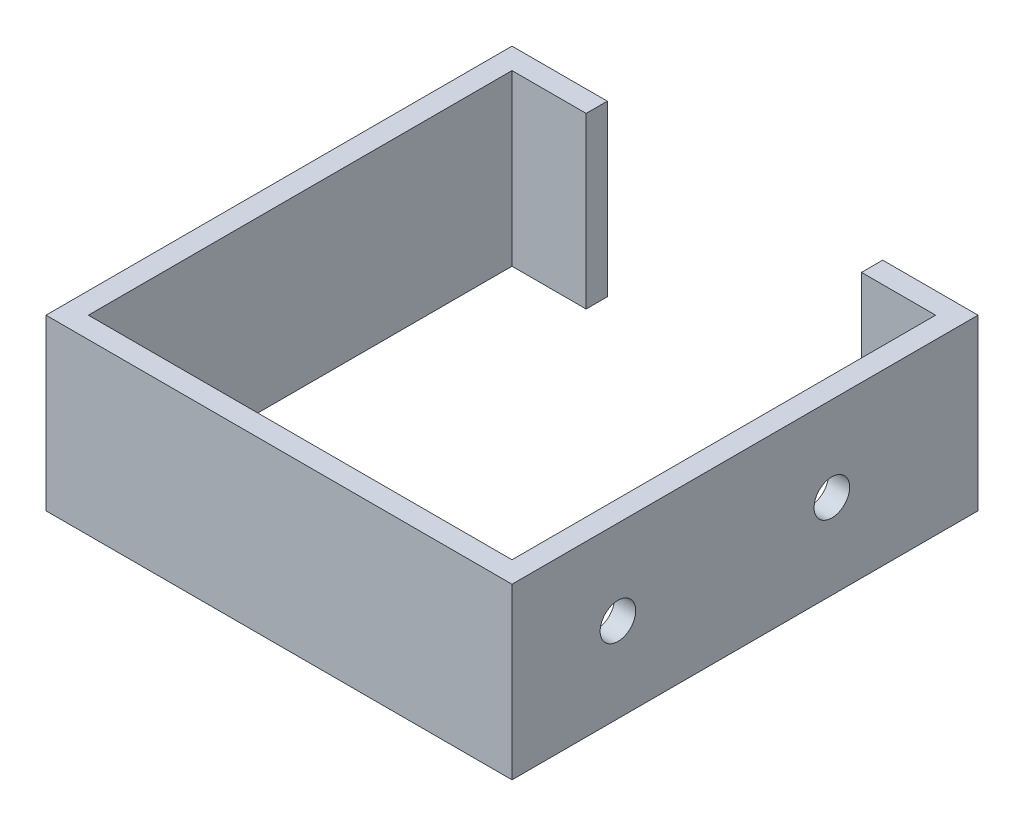
ISO-10303-21;
HEADER;
FILE_DESCRIPTION(('STEP AP214'),'2;1');
FILE_NAME('part.step','',(''),(''),'','','');
FILE_SCHEMA(('AUTOMOTIVE_DESIGN { 1 0 10303 214 1 1 1 1 }'));
ENDSEC;
DATA;
#1=APPLICATION_CONTEXT('core data for automotive mechanical design processes');
#2=APPLICATION_PROTOCOL_DEFINITION('international standard','automotive_design',2000,#1);
#3=PRODUCT_CONTEXT('',#1,'mechanical');
#4=PRODUCT('Part','Part','',(#3));
#5=PRODUCT_RELATED_PRODUCT_CATEGORY('part','',(#4));
#6=PRODUCT_DEFINITION_FORMATION('','',#4);
#7=PRODUCT_DEFINITION_CONTEXT('part definition',#1,'design');
#8=PRODUCT_DEFINITION('design','',#6,#7);
#9=PRODUCT_DEFINITION_SHAPE('','',#8);
#10=(LENGTH_UNIT() NAMED_UNIT(*) SI_UNIT(.MILLI.,.METRE.));
#11=(NAMED_UNIT(*) PLANE_ANGLE_UNIT() SI_UNIT($,.RADIAN.));
#12=(NAMED_UNIT(*) SI_UNIT($,.STERADIAN.) SOLID_ANGLE_UNIT());
#13=UNCERTAINTY_MEASURE_WITH_UNIT(LENGTH_MEASURE(1.E-05),#10,'distance_accuracy_value','');
#14=(GEOMETRIC_REPRESENTATION_CONTEXT(3) GLOBAL_UNCERTAINTY_ASSIGNED_CONTEXT((#13)) GLOBAL_UNIT_ASSIGNED_CONTEXT((#10,
#11,#12)) REPRESENTATION_CONTEXT('',''));
#15=CARTESIAN_POINT('',(0.,0.,0.));
#16=DIRECTION('',(0.,0.,1.));
#17=DIRECTION('',(1.,0.,0.));
#18=AXIS2_PLACEMENT_3D('',#15,#16,#17);
#19=CARTESIAN_POINT('',(0.,25.4,0.));
#20=DIRECTION('',(-1.,0.,0.));
#21=DIRECTION('',(0.,0.,1.));
#22=AXIS2_PLACEMENT_3D('',#19,#20,#21);
#23=PLANE('',#22);
#24=DIRECTION('',(0.,0.,-1.));
#25=VECTOR('',#24,1.);
#26=CARTESIAN_POINT('',(0.,0.,0.));
#27=LINE('',#26,#25);
#28=CARTESIAN_POINT('',(0.,0.,0.));
#29=VERTEX_POINT('',#28);
#30=CARTESIAN_POINT('',(0.,0.,-63.5));
#31=VERTEX_POINT('',#30);
#32=EDGE_CURVE('E152',#29,#31,#27,.T.);
#33=ORIENTED_EDGE('',*,*,#32,.T.);
#34=DIRECTION('',(0.,-1.,0.));
#35=VECTOR('',#34,1.);
#36=CARTESIAN_POINT('',(0.,25.4,-63.5));
#37=LINE('',#36,#35);
#38=CARTESIAN_POINT('',(0.,25.4,-63.5));
#39=VERTEX_POINT('',#38);
#40=EDGE_CURVE('E11',#39,#31,#37,.T.);
#41=ORIENTED_EDGE('',*,*,#40,.F.);
#42=DIRECTION('',(0.,0.,-1.));
#43=VECTOR('',#42,1.);
#44=CARTESIAN_POINT('',(0.,25.4,0.));
#45=LINE('',#44,#43);
#46=CARTESIAN_POINT('',(0.,25.4,0.));
#47=VERTEX_POINT('',#46);
#48=EDGE_CURVE('E177',#47,#39,#45,.T.);
#49=ORIENTED_EDGE('',*,*,#48,.F.);
#50=DIRECTION('',(0.,-1.,0.));
#51=VECTOR('',#50,1.);
#52=CARTESIAN_POINT('',(0.,25.4,0.));
#53=LINE('',#52,#51);
#54=EDGE_CURVE('E148',#47,#29,#53,.T.);
#55=ORIENTED_EDGE('',*,*,#54,.T.);
#56=EDGE_LOOP('',(#33,#41,#49,#55));
#57=FACE_BOUND('',#56,.T.);
#58=ADVANCED_FACE('F32',(#57),#23,.F.);
#59=CARTESIAN_POINT('',(0.,25.4,-63.5));
#60=DIRECTION('',(0.,0.,-1.));
#61=DIRECTION('',(-1.,0.,0.));
#62=AXIS2_PLACEMENT_3D('',#59,#60,#61);
#63=PLANE('',#62);
#64=DIRECTION('',(1.,0.,0.));
#65=VECTOR('',#64,1.);
#66=CARTESIAN_POINT('',(0.,0.,-63.5));
#67=LINE('',#66,#65);
#68=CARTESIAN_POINT('',(11.1125,0.,-63.5));
#69=VERTEX_POINT('',#68);
#70=EDGE_CURVE('E155',#31,#69,#67,.T.);
#71=ORIENTED_EDGE('',*,*,#70,.T.);
#72=DIRECTION('',(0.,-1.,0.));
#73=VECTOR('',#72,1.);
#74=CARTESIAN_POINT('',(11.1125,25.4,-63.5));
#75=LINE('',#74,#73);
#76=CARTESIAN_POINT('',(11.1125,25.4,-63.5));
#77=VERTEX_POINT('',#76);
#78=EDGE_CURVE('E40',#77,#69,#75,.T.);
#79=ORIENTED_EDGE('',*,*,#78,.F.);
#80=DIRECTION('',(1.,0.,0.));
#81=VECTOR('',#80,1.);
#82=CARTESIAN_POINT('',(0.,25.4,-63.5));
#83=LINE('',#82,#81);
#84=EDGE_CURVE('E103',#39,#77,#83,.T.);
#85=ORIENTED_EDGE('',*,*,#84,.F.);
#86=ORIENTED_EDGE('',*,*,#40,.T.);
#87=EDGE_LOOP('',(#71,#79,#85,#86));
#88=FACE_BOUND('',#87,.T.);
#89=ADVANCED_FACE('F255',(#88),#63,.F.);
#90=CARTESIAN_POINT('',(11.1125,25.4,-63.5));
#91=DIRECTION('',(-1.,0.,0.));
#92=DIRECTION('',(0.,0.,1.));
#93=AXIS2_PLACEMENT_3D('',#90,#91,#92);
#94=PLANE('',#93);
#95=DIRECTION('',(0.,0.,-1.));
#96=VECTOR('',#95,1.);
#97=CARTESIAN_POINT('',(11.1125,0.,-63.5));
#98=LINE('',#97,#96);
#99=CARTESIAN_POINT('',(11.1125,0.,-66.675));
#100=VERTEX_POINT('',#99);
#101=EDGE_CURVE('E158',#69,#100,#98,.T.);
#102=ORIENTED_EDGE('',*,*,#101,.T.);
#103=DIRECTION('',(0.,-1.,0.));
#104=VECTOR('',#103,1.);
#105=CARTESIAN_POINT('',(11.1125,25.4,-66.675));
#106=LINE('',#105,#104);
#107=CARTESIAN_POINT('',(11.1125,25.4,-66.675));
#108=VERTEX_POINT('',#107);
#109=EDGE_CURVE('E196',#108,#100,#106,.T.);
#110=ORIENTED_EDGE('',*,*,#109,.F.);
#111=DIRECTION('',(0.,0.,-1.));
#112=VECTOR('',#111,1.);
#113=CARTESIAN_POINT('',(11.1125,25.4,-63.5));
#114=LINE('',#113,#112);
#115=EDGE_CURVE('E204',#77,#108,#114,.T.);
#116=ORIENTED_EDGE('',*,*,#115,.F.);
#117=ORIENTED_EDGE('',*,*,#78,.T.);
#118=EDGE_LOOP('',(#102,#110,#116,#117));
#119=FACE_BOUND('',#118,.T.);
#120=ADVANCED_FACE('F202',(#119),#94,.F.);
#121=CARTESIAN_POINT('',(-3.175,25.4,-66.675));
#122=DIRECTION('',(0.,0.,1.));
#123=DIRECTION('',(1.,0.,0.));
#124=AXIS2_PLACEMENT_3D('',#121,#122,#123);
#125=PLANE('',#124);
#126=DIRECTION('',(-1.,0.,0.));
#127=VECTOR('',#126,1.);
#128=CARTESIAN_POINT('',(-3.175,0.,-66.675));
#129=LINE('',#128,#127);
#130=CARTESIAN_POINT('',(-3.175,0.,-66.675));
#131=VERTEX_POINT('',#130);
#132=EDGE_CURVE('E160',#100,#131,#129,.T.);
#133=ORIENTED_EDGE('',*,*,#132,.T.);
#134=DIRECTION('',(0.,-1.,0.));
#135=VECTOR('',#134,1.);
#136=CARTESIAN_POINT('',(-3.175,25.4,-66.675));
#137=LINE('',#136,#135);
#138=CARTESIAN_POINT('',(-3.175,25.4,-66.675));
#139=VERTEX_POINT('',#138);
#140=EDGE_CURVE('E193',#139,#131,#137,.T.);
#141=ORIENTED_EDGE('',*,*,#140,.F.);
#142=DIRECTION('',(-1.,0.,0.));
#143=VECTOR('',#142,1.);
#144=CARTESIAN_POINT('',(-3.175,25.4,-66.675));
#145=LINE('',#144,#143);
#146=EDGE_CURVE('E221',#108,#139,#145,.T.);
#147=ORIENTED_EDGE('',*,*,#146,.F.);
#148=ORIENTED_EDGE('',*,*,#109,.T.);
#149=EDGE_LOOP('',(#133,#141,#147,#148));
#150=FACE_BOUND('',#149,.T.);
#151=ADVANCED_FACE('F212',(#150),#125,.F.);
#152=CARTESIAN_POINT('',(-3.175,25.4,3.175));
#153=DIRECTION('',(1.,0.,0.));
#154=DIRECTION('',(0.,0.,-1.));
#155=AXIS2_PLACEMENT_3D('',#152,#153,#154);
#156=PLANE('',#155);
#157=DIRECTION('',(0.,0.,1.));
#158=VECTOR('',#157,1.);
#159=CARTESIAN_POINT('',(-3.175,0.,3.175));
#160=LINE('',#159,#158);
#161=CARTESIAN_POINT('',(-3.175,0.,3.175));
#162=VERTEX_POINT('',#161);
#163=EDGE_CURVE('E163',#131,#162,#160,.T.);
#164=ORIENTED_EDGE('',*,*,#163,.T.);
#165=DIRECTION('',(0.,-1.,0.));
#166=VECTOR('',#165,1.);
#167=CARTESIAN_POINT('',(-3.175,25.4,3.175));
#168=LINE('',#167,#166);
#169=CARTESIAN_POINT('',(-3.175,25.4,3.175));
#170=VERTEX_POINT('',#169);
#171=EDGE_CURVE('E190',#170,#162,#168,.T.);
#172=ORIENTED_EDGE('',*,*,#171,.F.);
#173=DIRECTION('',(0.,0.,1.));
#174=VECTOR('',#173,1.);
#175=CARTESIAN_POINT('',(-3.175,25.4,-63.5));
#176=LINE('',#175,#174);
#177=EDGE_CURVE('E218',#139,#170,#176,.T.);
#178=ORIENTED_EDGE('',*,*,#177,.F.);
#179=ORIENTED_EDGE('',*,*,#140,.T.);
#180=EDGE_LOOP('',(#164,#172,#178,#179));
#181=FACE_BOUND('',#180,.T.);
#182=ADVANCED_FACE('F216',(#181),#156,.F.);
#183=CARTESIAN_POINT('',(-3.175,25.4,3.175));
#184=DIRECTION('',(0.,0.,-1.));
#185=DIRECTION('',(-1.,0.,0.));
#186=AXIS2_PLACEMENT_3D('',#183,#184,#185);
#187=PLANE('',#186);
#188=DIRECTION('',(1.,0.,0.));
#189=VECTOR('',#188,1.);
#190=CARTESIAN_POINT('',(-3.175,0.,3.175));
#191=LINE('',#190,#189);
#192=CARTESIAN_POINT('',(66.675,0.,3.175));
#193=VERTEX_POINT('',#192);
#194=EDGE_CURVE('E165',#162,#193,#191,.T.);
#195=ORIENTED_EDGE('',*,*,#194,.T.);
#196=DIRECTION('',(0.,-1.,0.));
#197=VECTOR('',#196,1.);
#198=CARTESIAN_POINT('',(66.675,25.4,3.175));
#199=LINE('',#198,#197);
#200=CARTESIAN_POINT('',(66.675,25.4,3.175));
#201=VERTEX_POINT('',#200);
#202=EDGE_CURVE('E187',#201,#193,#199,.T.);
#203=ORIENTED_EDGE('',*,*,#202,.F.);
#204=DIRECTION('',(1.,0.,0.));
#205=VECTOR('',#204,1.);
#206=CARTESIAN_POINT('',(-3.175,25.4,3.175));
#207=LINE('',#206,#205);
#208=EDGE_CURVE('E220',#170,#201,#207,.T.);
#209=ORIENTED_EDGE('',*,*,#208,.F.);
#210=ORIENTED_EDGE('',*,*,#171,.T.);
#211=EDGE_LOOP('',(#195,#203,#209,#210));
#212=FACE_BOUND('',#211,.T.);
#213=ADVANCED_FACE('F268',(#212),#187,.F.);
#214=CARTESIAN_POINT('',(66.675,25.4,-63.5));
#215=DIRECTION('',(-1.,0.,0.));
#216=DIRECTION('',(0.,0.,1.));
#217=AXIS2_PLACEMENT_3D('',#214,#215,#216);
#218=PLANE('',#217);
#219=CARTESIAN_POINT('',(66.675,12.7,-12.7));
#220=DIRECTION('',(1.,0.,0.));
#221=DIRECTION('',(0.,0.,-1.));
#222=AXIS2_PLACEMENT_3D('',#219,#220,#221);
#223=CIRCLE('',#222,2.667);
#224=CARTESIAN_POINT('',(66.675,12.7,-15.367));
#225=VERTEX_POINT('',#224);
#226=EDGE_CURVE('E156',#225,#225,#223,.T.);
#227=ORIENTED_EDGE('',*,*,#226,.F.);
#228=EDGE_LOOP('',(#227));
#229=FACE_BOUND('',#228,.T.);
#230=CARTESIAN_POINT('',(66.675,12.7,-44.7675));
#231=DIRECTION('',(1.,0.,0.));
#232=DIRECTION('',(0.,0.,-1.));
#233=AXIS2_PLACEMENT_3D('',#230,#231,#232);
#234=CIRCLE('',#233,2.667);
#235=CARTESIAN_POINT('',(66.675,12.7,-47.4345));
#236=VERTEX_POINT('',#235);
#237=EDGE_CURVE('E339',#236,#236,#234,.T.);
#238=ORIENTED_EDGE('',*,*,#237,.F.);
#239=EDGE_LOOP('',(#238));
#240=FACE_BOUND('',#239,.T.);
#241=DIRECTION('',(0.,0.,-1.));
#242=VECTOR('',#241,1.);
#243=CARTESIAN_POINT('',(66.675,0.,-63.5));
#244=LINE('',#243,#242);
#245=CARTESIAN_POINT('',(66.675,0.,-66.675));
#246=VERTEX_POINT('',#245);
#247=EDGE_CURVE('E168',#193,#246,#244,.T.);
#248=ORIENTED_EDGE('',*,*,#247,.T.);
#249=DIRECTION('',(0.,-1.,0.));
#250=VECTOR('',#249,1.);
#251=CARTESIAN_POINT('',(66.675,25.4,-66.675));
#252=LINE('',#251,#250);
#253=CARTESIAN_POINT('',(66.675,25.4,-66.675));
#254=VERTEX_POINT('',#253);
#255=EDGE_CURVE('E184',#254,#246,#252,.T.);
#256=ORIENTED_EDGE('',*,*,#255,.F.);
#257=DIRECTION('',(0.,0.,-1.));
#258=VECTOR('',#257,1.);
#259=CARTESIAN_POINT('',(66.675,25.4,3.175));
#260=LINE('',#259,#258);
#261=EDGE_CURVE('E223',#201,#254,#260,.T.);
#262=ORIENTED_EDGE('',*,*,#261,.F.);
#263=ORIENTED_EDGE('',*,*,#202,.T.);
#264=EDGE_LOOP('',(#248,#256,#262,#263));
#265=FACE_BOUND('',#264,.T.);
#266=ADVANCED_FACE('F271',(#229,#240,#265),#218,.F.);
#267=CARTESIAN_POINT('',(66.675,25.4,-66.675));
#268=DIRECTION('',(0.,0.,1.));
#269=DIRECTION('',(1.,0.,0.));
#270=AXIS2_PLACEMENT_3D('',#267,#268,#269);
#271=PLANE('',#270);
#272=DIRECTION('',(-1.,0.,0.));
#273=VECTOR('',#272,1.);
#274=CARTESIAN_POINT('',(66.675,0.,-66.675));
#275=LINE('',#274,#273);
#276=CARTESIAN_POINT('',(52.3875,0.,-66.675));
#277=VERTEX_POINT('',#276);
#278=EDGE_CURVE('E170',#246,#277,#275,.T.);
#279=ORIENTED_EDGE('',*,*,#278,.T.);
#280=DIRECTION('',(0.,-1.,0.));
#281=VECTOR('',#280,1.);
#282=CARTESIAN_POINT('',(52.3875,25.4,-66.675));
#283=LINE('',#282,#281);
#284=CARTESIAN_POINT('',(52.3875,25.4,-66.675));
#285=VERTEX_POINT('',#284);
#286=EDGE_CURVE('E181',#285,#277,#283,.T.);
#287=ORIENTED_EDGE('',*,*,#286,.F.);
#288=DIRECTION('',(-1.,0.,0.));
#289=VECTOR('',#288,1.);
#290=CARTESIAN_POINT('',(66.675,25.4,-66.675));
#291=LINE('',#290,#289);
#292=EDGE_CURVE('E229',#254,#285,#291,.T.);
#293=ORIENTED_EDGE('',*,*,#292,.F.);
#294=ORIENTED_EDGE('',*,*,#255,.T.);
#295=EDGE_LOOP('',(#279,#287,#293,#294));
#296=FACE_BOUND('',#295,.T.);
#297=ADVANCED_FACE('F235',(#296),#271,.F.);
#298=CARTESIAN_POINT('',(52.3875,25.4,-63.5));
#299=DIRECTION('',(1.,0.,0.));
#300=DIRECTION('',(0.,0.,-1.));
#301=AXIS2_PLACEMENT_3D('',#298,#299,#300);
#302=PLANE('',#301);
#303=DIRECTION('',(0.,0.,1.));
#304=VECTOR('',#303,1.);
#305=CARTESIAN_POINT('',(52.3875,0.,-63.5));
#306=LINE('',#305,#304);
#307=CARTESIAN_POINT('',(52.3875,0.,-63.5));
#308=VERTEX_POINT('',#307);
#309=EDGE_CURVE('E172',#277,#308,#306,.T.);
#310=ORIENTED_EDGE('',*,*,#309,.T.);
#311=DIRECTION('',(0.,-1.,0.));
#312=VECTOR('',#311,1.);
#313=CARTESIAN_POINT('',(52.3875,25.4,-63.5));
#314=LINE('',#313,#312);
#315=CARTESIAN_POINT('',(52.3875,25.4,-63.5));
#316=VERTEX_POINT('',#315);
#317=EDGE_CURVE('E143',#316,#308,#314,.T.);
#318=ORIENTED_EDGE('',*,*,#317,.F.);
#319=DIRECTION('',(0.,0.,1.));
#320=VECTOR('',#319,1.);
#321=CARTESIAN_POINT('',(52.3875,25.4,-63.5));
#322=LINE('',#321,#320);
#323=EDGE_CURVE('E134',#285,#316,#322,.T.);
#324=ORIENTED_EDGE('',*,*,#323,.F.);
#325=ORIENTED_EDGE('',*,*,#286,.T.);
#326=EDGE_LOOP('',(#310,#318,#324,#325));
#327=FACE_BOUND('',#326,.T.);
#328=ADVANCED_FACE('F239',(#327),#302,.F.);
#329=CARTESIAN_POINT('',(63.5,25.4,-63.5));
#330=DIRECTION('',(0.,0.,-1.));
#331=DIRECTION('',(-1.,0.,0.));
#332=AXIS2_PLACEMENT_3D('',#329,#330,#331);
#333=PLANE('',#332);
#334=DIRECTION('',(1.,0.,0.));
#335=VECTOR('',#334,1.);
#336=CARTESIAN_POINT('',(63.5,0.,-63.5));
#337=LINE('',#336,#335);
#338=CARTESIAN_POINT('',(63.5,0.,-63.5));
#339=VERTEX_POINT('',#338);
#340=EDGE_CURVE('E142',#308,#339,#337,.T.);
#341=ORIENTED_EDGE('',*,*,#340,.T.);
#342=DIRECTION('',(0.,-1.,0.));
#343=VECTOR('',#342,1.);
#344=CARTESIAN_POINT('',(63.5,25.4,-63.5));
#345=LINE('',#344,#343);
#346=CARTESIAN_POINT('',(63.5,25.4,-63.5));
#347=VERTEX_POINT('',#346);
#348=EDGE_CURVE('E139',#347,#339,#345,.T.);
#349=ORIENTED_EDGE('',*,*,#348,.F.);
#350=DIRECTION('',(1.,0.,0.));
#351=VECTOR('',#350,1.);
#352=CARTESIAN_POINT('',(63.5,25.4,-63.5));
#353=LINE('',#352,#351);
#354=EDGE_CURVE('E128',#316,#347,#353,.T.);
#355=ORIENTED_EDGE('',*,*,#354,.F.);
#356=ORIENTED_EDGE('',*,*,#317,.T.);
#357=EDGE_LOOP('',(#341,#349,#355,#356));
#358=FACE_BOUND('',#357,.T.);
#359=ADVANCED_FACE('F140',(#358),#333,.F.);
#360=CARTESIAN_POINT('',(63.5,25.4,0.));
#361=DIRECTION('',(1.,0.,0.));
#362=DIRECTION('',(0.,0.,-1.));
#363=AXIS2_PLACEMENT_3D('',#360,#361,#362);
#364=PLANE('',#363);
#365=CARTESIAN_POINT('',(63.5,12.7,-12.7));
#366=DIRECTION('',(1.,0.,0.));
#367=DIRECTION('',(0.,0.,-1.));
#368=AXIS2_PLACEMENT_3D('',#365,#366,#367);
#369=CIRCLE('',#368,2.667);
#370=CARTESIAN_POINT('',(63.5,12.7,-15.367));
#371=VERTEX_POINT('',#370);
#372=EDGE_CURVE('E338',#371,#371,#369,.F.);
#373=ORIENTED_EDGE('',*,*,#372,.F.);
#374=EDGE_LOOP('',(#373));
#375=FACE_BOUND('',#374,.T.);
#376=CARTESIAN_POINT('',(63.5,12.7,-44.7675));
#377=DIRECTION('',(1.,0.,0.));
#378=DIRECTION('',(0.,0.,-1.));
#379=AXIS2_PLACEMENT_3D('',#376,#377,#378);
#380=CIRCLE('',#379,2.667);
#381=CARTESIAN_POINT('',(63.5,12.7,-47.4345));
#382=VERTEX_POINT('',#381);
#383=EDGE_CURVE('E343',#382,#382,#380,.F.);
#384=ORIENTED_EDGE('',*,*,#383,.F.);
#385=EDGE_LOOP('',(#384));
#386=FACE_BOUND('',#385,.T.);
#387=DIRECTION('',(0.,0.,1.));
#388=VECTOR('',#387,1.);
#389=CARTESIAN_POINT('',(63.5,0.,0.));
#390=LINE('',#389,#388);
#391=CARTESIAN_POINT('',(63.5,0.,0.));
#392=VERTEX_POINT('',#391);
#393=EDGE_CURVE('E89',#339,#392,#390,.T.);
#394=ORIENTED_EDGE('',*,*,#393,.T.);
#395=DIRECTION('',(0.,-1.,0.));
#396=VECTOR('',#395,1.);
#397=CARTESIAN_POINT('',(63.5,25.4,0.));
#398=LINE('',#397,#396);
#399=CARTESIAN_POINT('',(63.5,25.4,0.));
#400=VERTEX_POINT('',#399);
#401=EDGE_CURVE('E144',#400,#392,#398,.T.);
#402=ORIENTED_EDGE('',*,*,#401,.F.);
#403=DIRECTION('',(0.,0.,1.));
#404=VECTOR('',#403,1.);
#405=CARTESIAN_POINT('',(63.5,25.4,0.));
#406=LINE('',#405,#404);
#407=EDGE_CURVE('E132',#347,#400,#406,.T.);
#408=ORIENTED_EDGE('',*,*,#407,.F.);
#409=ORIENTED_EDGE('',*,*,#348,.T.);
#410=EDGE_LOOP('',(#394,#402,#408,#409));
#411=FACE_BOUND('',#410,.T.);
#412=ADVANCED_FACE('F146',(#375,#386,#411),#364,.F.);
#413=CARTESIAN_POINT('',(0.,25.4,0.));
#414=DIRECTION('',(0.,0.,1.));
#415=DIRECTION('',(1.,0.,0.));
#416=AXIS2_PLACEMENT_3D('',#413,#414,#415);
#417=PLANE('',#416);
#418=DIRECTION('',(-1.,0.,0.));
#419=VECTOR('',#418,1.);
#420=CARTESIAN_POINT('',(0.,0.,0.));
#421=LINE('',#420,#419);
#422=EDGE_CURVE('E95',#392,#29,#421,.T.);
#423=ORIENTED_EDGE('',*,*,#422,.T.);
#424=ORIENTED_EDGE('',*,*,#54,.F.);
#425=DIRECTION('',(-1.,0.,0.));
#426=VECTOR('',#425,1.);
#427=CARTESIAN_POINT('',(0.,25.4,0.));
#428=LINE('',#427,#426);
#429=EDGE_CURVE('E48',#400,#47,#428,.T.);
#430=ORIENTED_EDGE('',*,*,#429,.F.);
#431=ORIENTED_EDGE('',*,*,#401,.T.);
#432=EDGE_LOOP('',(#423,#424,#430,#431));
#433=FACE_BOUND('',#432,.T.);
#434=ADVANCED_FACE('F243',(#433),#417,.F.);
#435=CARTESIAN_POINT('',(0.,25.4,0.));
#436=DIRECTION('',(0.,-1.,0.));
#437=DIRECTION('',(0.,0.,-1.));
#438=AXIS2_PLACEMENT_3D('',#435,#436,#437);
#439=PLANE('',#438);
#440=ORIENTED_EDGE('',*,*,#48,.T.);
#441=ORIENTED_EDGE('',*,*,#84,.T.);
#442=ORIENTED_EDGE('',*,*,#115,.T.);
#443=ORIENTED_EDGE('',*,*,#146,.T.);
#444=ORIENTED_EDGE('',*,*,#177,.T.);
#445=ORIENTED_EDGE('',*,*,#208,.T.);
#446=ORIENTED_EDGE('',*,*,#261,.T.);
#447=ORIENTED_EDGE('',*,*,#292,.T.);
#448=ORIENTED_EDGE('',*,*,#323,.T.);
#449=ORIENTED_EDGE('',*,*,#354,.T.);
#450=ORIENTED_EDGE('',*,*,#407,.T.);
#451=ORIENTED_EDGE('',*,*,#429,.T.);
#452=EDGE_LOOP('',(#440,#441,#442,#443,#444,#445,#446,#447,#448,#449,#450,#451));
#453=FACE_BOUND('',#452,.T.);
#454=ADVANCED_FACE('F130',(#453),#439,.F.);
#455=CARTESIAN_POINT('',(0.,0.,0.));
#456=DIRECTION('',(0.,-1.,0.));
#457=DIRECTION('',(0.,0.,-1.));
#458=AXIS2_PLACEMENT_3D('',#455,#456,#457);
#459=PLANE('',#458);
#460=ORIENTED_EDGE('',*,*,#32,.F.);
#461=ORIENTED_EDGE('',*,*,#422,.F.);
#462=ORIENTED_EDGE('',*,*,#393,.F.);
#463=ORIENTED_EDGE('',*,*,#340,.F.);
#464=ORIENTED_EDGE('',*,*,#309,.F.);
#465=ORIENTED_EDGE('',*,*,#278,.F.);
#466=ORIENTED_EDGE('',*,*,#247,.F.);
#467=ORIENTED_EDGE('',*,*,#194,.F.);
#468=ORIENTED_EDGE('',*,*,#163,.F.);
#469=ORIENTED_EDGE('',*,*,#132,.F.);
#470=ORIENTED_EDGE('',*,*,#101,.F.);
#471=ORIENTED_EDGE('',*,*,#70,.F.);
#472=EDGE_LOOP('',(#460,#461,#462,#463,#464,#465,#466,#467,#468,#469,#470,#471));
#473=FACE_BOUND('',#472,.T.);
#474=ADVANCED_FACE('F208',(#473),#459,.T.);
#475=CARTESIAN_POINT('',(-3.176,12.7,-44.7675));
#476=DIRECTION('',(1.,0.,0.));
#477=DIRECTION('',(0.,0.,-1.));
#478=AXIS2_PLACEMENT_3D('',#475,#476,#477);
#479=CYLINDRICAL_SURFACE('',#478,2.667);
#480=ORIENTED_EDGE('',*,*,#237,.T.);
#481=EDGE_LOOP('',(#480));
#482=FACE_BOUND('',#481,.T.);
#483=ORIENTED_EDGE('',*,*,#383,.T.);
#484=EDGE_LOOP('',(#483));
#485=FACE_BOUND('',#484,.T.);
#486=ADVANCED_FACE('F299',(#482,#485),#479,.F.);
#487=CARTESIAN_POINT('',(-3.176,12.7,-12.7));
#488=DIRECTION('',(1.,0.,0.));
#489=DIRECTION('',(0.,0.,-1.));
#490=AXIS2_PLACEMENT_3D('',#487,#488,#489);
#491=CYLINDRICAL_SURFACE('',#490,2.667);
#492=ORIENTED_EDGE('',*,*,#226,.T.);
#493=EDGE_LOOP('',(#492));
#494=FACE_BOUND('',#493,.T.);
#495=ORIENTED_EDGE('',*,*,#372,.T.);
#496=EDGE_LOOP('',(#495));
#497=FACE_BOUND('',#496,.T.);
#498=ADVANCED_FACE('F304',(#494,#497),#491,.F.);
#499=CLOSED_SHELL('',(#58,#89,#120,#151,#182,#213,#266,#297,#328,#359,#412,#434,#454,#474,#486,#498));
#500=MANIFOLD_SOLID_BREP('B2',#499);
#501=ADVANCED_BREP_SHAPE_REPRESENTATION('',(#18,#500),#14);
#502=SHAPE_DEFINITION_REPRESENTATION(#9,#501);
ENDSEC;
END-ISO-10303-21;
